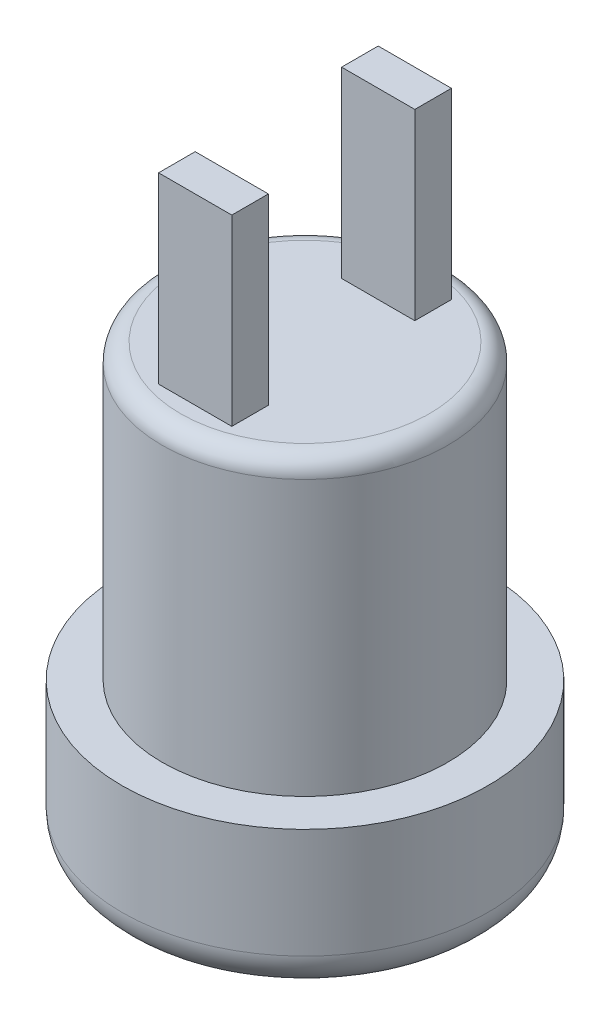
ISO-10303-21;
HEADER;
FILE_DESCRIPTION(('STEP AP214'),'2;1');
FILE_NAME('part.step','',(''),(''),'','','');
FILE_SCHEMA(('AUTOMOTIVE_DESIGN { 1 0 10303 214 1 1 1 1 }'));
ENDSEC;
DATA;
#1=APPLICATION_CONTEXT('core data for automotive mechanical design processes');
#2=APPLICATION_PROTOCOL_DEFINITION('international standard','automotive_design',2000,#1);
#3=PRODUCT_CONTEXT('',#1,'mechanical');
#4=PRODUCT('Part','Part','',(#3));
#5=PRODUCT_RELATED_PRODUCT_CATEGORY('part','',(#4));
#6=PRODUCT_DEFINITION_FORMATION('','',#4);
#7=PRODUCT_DEFINITION_CONTEXT('part definition',#1,'design');
#8=PRODUCT_DEFINITION('design','',#6,#7);
#9=PRODUCT_DEFINITION_SHAPE('','',#8);
#10=(LENGTH_UNIT() NAMED_UNIT(*) SI_UNIT(.MILLI.,.METRE.));
#11=(NAMED_UNIT(*) PLANE_ANGLE_UNIT() SI_UNIT($,.RADIAN.));
#12=(NAMED_UNIT(*) SI_UNIT($,.STERADIAN.) SOLID_ANGLE_UNIT());
#13=UNCERTAINTY_MEASURE_WITH_UNIT(LENGTH_MEASURE(1.E-05),#10,'distance_accuracy_value','');
#14=(GEOMETRIC_REPRESENTATION_CONTEXT(3) GLOBAL_UNCERTAINTY_ASSIGNED_CONTEXT((#13)) GLOBAL_UNIT_ASSIGNED_CONTEXT((#10,
#11,#12)) REPRESENTATION_CONTEXT('',''));
#15=CARTESIAN_POINT('',(0.,0.,0.));
#16=DIRECTION('',(0.,0.,1.));
#17=DIRECTION('',(1.,0.,0.));
#18=AXIS2_PLACEMENT_3D('',#15,#16,#17);
#19=CARTESIAN_POINT('',(0.,12.,0.));
#20=DIRECTION('',(0.,1.,0.));
#21=DIRECTION('',(0.,0.,1.));
#22=AXIS2_PLACEMENT_3D('',#19,#20,#21);
#23=PLANE('',#22);
#24=CARTESIAN_POINT('',(0.,12.,0.));
#25=DIRECTION('',(0.,1.,0.));
#26=DIRECTION('',(0.,0.,1.));
#27=AXIS2_PLACEMENT_3D('',#24,#25,#26);
#28=CIRCLE('',#27,3.4);
#29=CARTESIAN_POINT('',(0.,12.,3.4));
#30=VERTEX_POINT('',#29);
#31=EDGE_CURVE('E53',#30,#30,#28,.T.);
#32=ORIENTED_EDGE('',*,*,#31,.T.);
#33=EDGE_LOOP('',(#32));
#34=FACE_BOUND('',#33,.T.);
#35=DIRECTION('',(-1.,0.,0.));
#36=VECTOR('',#35,1.);
#37=CARTESIAN_POINT('',(1.,12.,2.));
#38=LINE('',#37,#36);
#39=CARTESIAN_POINT('',(1.,12.,2.));
#40=VERTEX_POINT('',#39);
#41=CARTESIAN_POINT('',(-1.,12.,2.));
#42=VERTEX_POINT('',#41);
#43=EDGE_CURVE('E139',#40,#42,#38,.T.);
#44=ORIENTED_EDGE('',*,*,#43,.F.);
#45=DIRECTION('',(0.,0.,-1.));
#46=VECTOR('',#45,1.);
#47=CARTESIAN_POINT('',(1.,12.,3.));
#48=LINE('',#47,#46);
#49=CARTESIAN_POINT('',(1.,12.,3.));
#50=VERTEX_POINT('',#49);
#51=EDGE_CURVE('E136',#50,#40,#48,.T.);
#52=ORIENTED_EDGE('',*,*,#51,.F.);
#53=DIRECTION('',(1.,0.,0.));
#54=VECTOR('',#53,1.);
#55=CARTESIAN_POINT('',(1.,12.,3.));
#56=LINE('',#55,#54);
#57=CARTESIAN_POINT('',(-1.,12.,3.));
#58=VERTEX_POINT('',#57);
#59=EDGE_CURVE('E148',#58,#50,#56,.T.);
#60=ORIENTED_EDGE('',*,*,#59,.F.);
#61=DIRECTION('',(0.,0.,1.));
#62=VECTOR('',#61,1.);
#63=CARTESIAN_POINT('',(-1.,12.,3.));
#64=LINE('',#63,#62);
#65=EDGE_CURVE('E156',#42,#58,#64,.T.);
#66=ORIENTED_EDGE('',*,*,#65,.F.);
#67=EDGE_LOOP('',(#44,#52,#60,#66));
#68=FACE_BOUND('',#67,.T.);
#69=DIRECTION('',(0.,0.,1.));
#70=VECTOR('',#69,1.);
#71=CARTESIAN_POINT('',(-1.,12.,-3.));
#72=LINE('',#71,#70);
#73=CARTESIAN_POINT('',(-1.,12.,-3.));
#74=VERTEX_POINT('',#73);
#75=CARTESIAN_POINT('',(-1.,12.,-2.));
#76=VERTEX_POINT('',#75);
#77=EDGE_CURVE('E284',#74,#76,#72,.T.);
#78=ORIENTED_EDGE('',*,*,#77,.F.);
#79=DIRECTION('',(-1.,0.,0.));
#80=VECTOR('',#79,1.);
#81=CARTESIAN_POINT('',(1.,12.,-3.));
#82=LINE('',#81,#80);
#83=CARTESIAN_POINT('',(1.,12.,-3.));
#84=VERTEX_POINT('',#83);
#85=EDGE_CURVE('E134',#84,#74,#82,.T.);
#86=ORIENTED_EDGE('',*,*,#85,.F.);
#87=DIRECTION('',(0.,0.,-1.));
#88=VECTOR('',#87,1.);
#89=CARTESIAN_POINT('',(1.,12.,-3.));
#90=LINE('',#89,#88);
#91=CARTESIAN_POINT('',(1.,12.,-2.));
#92=VERTEX_POINT('',#91);
#93=EDGE_CURVE('E130',#92,#84,#90,.T.);
#94=ORIENTED_EDGE('',*,*,#93,.F.);
#95=DIRECTION('',(1.,0.,0.));
#96=VECTOR('',#95,1.);
#97=CARTESIAN_POINT('',(1.,12.,-2.));
#98=LINE('',#97,#96);
#99=EDGE_CURVE('E281',#76,#92,#98,.T.);
#100=ORIENTED_EDGE('',*,*,#99,.F.);
#101=EDGE_LOOP('',(#78,#86,#94,#100));
#102=FACE_BOUND('',#101,.T.);
#103=ADVANCED_FACE('F45',(#34,#68,#102),#23,.T.);
#104=CARTESIAN_POINT('',(0.,4.,0.));
#105=DIRECTION('',(0.,-1.,0.));
#106=DIRECTION('',(0.,0.,-1.));
#107=AXIS2_PLACEMENT_3D('',#104,#105,#106);
#108=CYLINDRICAL_SURFACE('',#107,5.);
#109=CARTESIAN_POINT('',(0.,1.,0.));
#110=DIRECTION('',(0.,1.,0.));
#111=DIRECTION('',(0.,0.,1.));
#112=AXIS2_PLACEMENT_3D('',#109,#110,#111);
#113=CIRCLE('',#112,5.);
#114=CARTESIAN_POINT('',(0.,1.,5.));
#115=VERTEX_POINT('',#114);
#116=EDGE_CURVE('E177',#115,#115,#113,.T.);
#117=ORIENTED_EDGE('',*,*,#116,.T.);
#118=EDGE_LOOP('',(#117));
#119=FACE_BOUND('',#118,.T.);
#120=CARTESIAN_POINT('',(0.,4.,0.));
#121=DIRECTION('',(0.,1.,0.));
#122=DIRECTION('',(0.,0.,1.));
#123=AXIS2_PLACEMENT_3D('',#120,#121,#122);
#124=CIRCLE('',#123,5.);
#125=CARTESIAN_POINT('',(0.,4.,5.));
#126=VERTEX_POINT('',#125);
#127=EDGE_CURVE('E171',#126,#126,#124,.T.);
#128=ORIENTED_EDGE('',*,*,#127,.F.);
#129=EDGE_LOOP('',(#128));
#130=FACE_BOUND('',#129,.T.);
#131=ADVANCED_FACE('F198',(#119,#130),#108,.T.);
#132=CARTESIAN_POINT('',(0.,4.,0.));
#133=DIRECTION('',(0.,1.,0.));
#134=DIRECTION('',(0.,0.,1.));
#135=AXIS2_PLACEMENT_3D('',#132,#133,#134);
#136=PLANE('',#135);
#137=CARTESIAN_POINT('',(0.,4.,0.));
#138=DIRECTION('',(0.,1.,0.));
#139=DIRECTION('',(0.,0.,1.));
#140=AXIS2_PLACEMENT_3D('',#137,#138,#139);
#141=CIRCLE('',#140,3.9);
#142=CARTESIAN_POINT('',(0.,4.,3.9));
#143=VERTEX_POINT('',#142);
#144=EDGE_CURVE('E174',#143,#143,#141,.T.);
#145=ORIENTED_EDGE('',*,*,#144,.F.);
#146=EDGE_LOOP('',(#145));
#147=FACE_BOUND('',#146,.T.);
#148=ORIENTED_EDGE('',*,*,#127,.T.);
#149=EDGE_LOOP('',(#148));
#150=FACE_BOUND('',#149,.T.);
#151=ADVANCED_FACE('F205',(#147,#150),#136,.T.);
#152=CARTESIAN_POINT('',(0.,0.,0.));
#153=DIRECTION('',(0.,1.,0.));
#154=DIRECTION('',(0.,0.,1.));
#155=AXIS2_PLACEMENT_3D('',#152,#153,#154);
#156=PLANE('',#155);
#157=CARTESIAN_POINT('',(0.,0.,0.));
#158=DIRECTION('',(0.,-1.,0.));
#159=DIRECTION('',(0.,0.,-1.));
#160=AXIS2_PLACEMENT_3D('',#157,#158,#159);
#161=CIRCLE('',#160,3.);
#162=CARTESIAN_POINT('',(0.,0.,-3.));
#163=VERTEX_POINT('',#162);
#164=EDGE_CURVE('E167',#163,#163,#161,.T.);
#165=ORIENTED_EDGE('',*,*,#164,.F.);
#166=EDGE_LOOP('',(#165));
#167=FACE_BOUND('',#166,.T.);
#168=CARTESIAN_POINT('',(0.,0.,0.));
#169=DIRECTION('',(0.,1.,0.));
#170=DIRECTION('',(0.,0.,1.));
#171=AXIS2_PLACEMENT_3D('',#168,#169,#170);
#172=CIRCLE('',#171,4.);
#173=CARTESIAN_POINT('',(0.,0.,4.));
#174=VERTEX_POINT('',#173);
#175=EDGE_CURVE('E182',#174,#174,#172,.F.);
#176=ORIENTED_EDGE('',*,*,#175,.T.);
#177=EDGE_LOOP('',(#176));
#178=FACE_BOUND('',#177,.T.);
#179=ADVANCED_FACE('F215',(#167,#178),#156,.F.);
#180=CARTESIAN_POINT('',(0.,12.,0.));
#181=DIRECTION('',(0.,-1.,0.));
#182=DIRECTION('',(0.,0.,-1.));
#183=AXIS2_PLACEMENT_3D('',#180,#181,#182);
#184=CYLINDRICAL_SURFACE('',#183,3.9);
#185=CARTESIAN_POINT('',(0.,11.5,0.));
#186=DIRECTION('',(0.,1.,0.));
#187=DIRECTION('',(0.,0.,1.));
#188=AXIS2_PLACEMENT_3D('',#185,#186,#187);
#189=CIRCLE('',#188,3.9);
#190=CARTESIAN_POINT('',(0.,11.5,3.9));
#191=VERTEX_POINT('',#190);
#192=EDGE_CURVE('E11',#191,#191,#189,.F.);
#193=ORIENTED_EDGE('',*,*,#192,.T.);
#194=EDGE_LOOP('',(#193));
#195=FACE_BOUND('',#194,.T.);
#196=ORIENTED_EDGE('',*,*,#144,.T.);
#197=EDGE_LOOP('',(#196));
#198=FACE_BOUND('',#197,.T.);
#199=ADVANCED_FACE('F212',(#195,#198),#184,.T.);
#200=CARTESIAN_POINT('',(0.,1.,0.));
#201=DIRECTION('',(0.,1.,0.));
#202=DIRECTION('',(0.,0.,1.));
#203=AXIS2_PLACEMENT_3D('',#200,#201,#202);
#204=TOROIDAL_SURFACE('',#203,4.,1.);
#205=ORIENTED_EDGE('',*,*,#175,.F.);
#206=EDGE_LOOP('',(#205));
#207=FACE_BOUND('',#206,.T.);
#208=ORIENTED_EDGE('',*,*,#116,.F.);
#209=EDGE_LOOP('',(#208));
#210=FACE_BOUND('',#209,.T.);
#211=ADVANCED_FACE('F214',(#207,#210),#204,.T.);
#212=CARTESIAN_POINT('',(0.,6.,0.));
#213=DIRECTION('',(0.,-1.,0.));
#214=DIRECTION('',(0.,0.,-1.));
#215=AXIS2_PLACEMENT_3D('',#212,#213,#214);
#216=CYLINDRICAL_SURFACE('',#215,3.);
#217=CARTESIAN_POINT('',(0.,6.,0.));
#218=DIRECTION('',(0.,-1.,0.));
#219=DIRECTION('',(0.,0.,-1.));
#220=AXIS2_PLACEMENT_3D('',#217,#218,#219);
#221=CIRCLE('',#220,3.);
#222=CARTESIAN_POINT('',(0.,6.,-3.));
#223=VERTEX_POINT('',#222);
#224=EDGE_CURVE('E168',#223,#223,#221,.T.);
#225=ORIENTED_EDGE('',*,*,#224,.F.);
#226=EDGE_LOOP('',(#225));
#227=FACE_BOUND('',#226,.T.);
#228=ORIENTED_EDGE('',*,*,#164,.T.);
#229=EDGE_LOOP('',(#228));
#230=FACE_BOUND('',#229,.T.);
#231=ADVANCED_FACE('F210',(#227,#230),#216,.F.);
#232=CARTESIAN_POINT('',(0.,6.,0.));
#233=DIRECTION('',(0.,-1.,0.));
#234=DIRECTION('',(0.,0.,-1.));
#235=AXIS2_PLACEMENT_3D('',#232,#233,#234);
#236=PLANE('',#235);
#237=ORIENTED_EDGE('',*,*,#224,.T.);
#238=EDGE_LOOP('',(#237));
#239=FACE_BOUND('',#238,.T.);
#240=ADVANCED_FACE('F227',(#239),#236,.T.);
#241=CARTESIAN_POINT('',(1.,17.,3.));
#242=DIRECTION('',(-1.,0.,0.));
#243=DIRECTION('',(0.,0.,1.));
#244=AXIS2_PLACEMENT_3D('',#241,#242,#243);
#245=PLANE('',#244);
#246=ORIENTED_EDGE('',*,*,#51,.T.);
#247=DIRECTION('',(0.,-1.,0.));
#248=VECTOR('',#247,1.);
#249=CARTESIAN_POINT('',(1.,17.,2.));
#250=LINE('',#249,#248);
#251=CARTESIAN_POINT('',(1.,17.,2.));
#252=VERTEX_POINT('',#251);
#253=EDGE_CURVE('E165',#252,#40,#250,.T.);
#254=ORIENTED_EDGE('',*,*,#253,.F.);
#255=DIRECTION('',(0.,0.,-1.));
#256=VECTOR('',#255,1.);
#257=CARTESIAN_POINT('',(1.,17.,3.));
#258=LINE('',#257,#256);
#259=CARTESIAN_POINT('',(1.,17.,3.));
#260=VERTEX_POINT('',#259);
#261=EDGE_CURVE('E144',#260,#252,#258,.T.);
#262=ORIENTED_EDGE('',*,*,#261,.F.);
#263=DIRECTION('',(0.,-1.,0.));
#264=VECTOR('',#263,1.);
#265=CARTESIAN_POINT('',(1.,17.,3.));
#266=LINE('',#265,#264);
#267=EDGE_CURVE('E153',#260,#50,#266,.T.);
#268=ORIENTED_EDGE('',*,*,#267,.T.);
#269=EDGE_LOOP('',(#246,#254,#262,#268));
#270=FACE_BOUND('',#269,.T.);
#271=ADVANCED_FACE('F239',(#270),#245,.F.);
#272=CARTESIAN_POINT('',(1.,17.,2.));
#273=DIRECTION('',(0.,0.,1.));
#274=DIRECTION('',(1.,0.,0.));
#275=AXIS2_PLACEMENT_3D('',#272,#273,#274);
#276=PLANE('',#275);
#277=ORIENTED_EDGE('',*,*,#43,.T.);
#278=DIRECTION('',(0.,-1.,0.));
#279=VECTOR('',#278,1.);
#280=CARTESIAN_POINT('',(-1.,17.,2.));
#281=LINE('',#280,#279);
#282=CARTESIAN_POINT('',(-1.,17.,2.));
#283=VERTEX_POINT('',#282);
#284=EDGE_CURVE('E162',#283,#42,#281,.T.);
#285=ORIENTED_EDGE('',*,*,#284,.F.);
#286=DIRECTION('',(-1.,0.,0.));
#287=VECTOR('',#286,1.);
#288=CARTESIAN_POINT('',(1.,17.,2.));
#289=LINE('',#288,#287);
#290=EDGE_CURVE('E147',#252,#283,#289,.T.);
#291=ORIENTED_EDGE('',*,*,#290,.F.);
#292=ORIENTED_EDGE('',*,*,#253,.T.);
#293=EDGE_LOOP('',(#277,#285,#291,#292));
#294=FACE_BOUND('',#293,.T.);
#295=ADVANCED_FACE('F248',(#294),#276,.F.);
#296=CARTESIAN_POINT('',(-1.,17.,3.));
#297=DIRECTION('',(1.,0.,0.));
#298=DIRECTION('',(0.,0.,-1.));
#299=AXIS2_PLACEMENT_3D('',#296,#297,#298);
#300=PLANE('',#299);
#301=ORIENTED_EDGE('',*,*,#65,.T.);
#302=DIRECTION('',(0.,-1.,0.));
#303=VECTOR('',#302,1.);
#304=CARTESIAN_POINT('',(-1.,17.,3.));
#305=LINE('',#304,#303);
#306=CARTESIAN_POINT('',(-1.,17.,3.));
#307=VERTEX_POINT('',#306);
#308=EDGE_CURVE('E68',#307,#58,#305,.T.);
#309=ORIENTED_EDGE('',*,*,#308,.F.);
#310=DIRECTION('',(0.,0.,1.));
#311=VECTOR('',#310,1.);
#312=CARTESIAN_POINT('',(-1.,17.,3.));
#313=LINE('',#312,#311);
#314=EDGE_CURVE('E150',#283,#307,#313,.T.);
#315=ORIENTED_EDGE('',*,*,#314,.F.);
#316=ORIENTED_EDGE('',*,*,#284,.T.);
#317=EDGE_LOOP('',(#301,#309,#315,#316));
#318=FACE_BOUND('',#317,.T.);
#319=ADVANCED_FACE('F254',(#318),#300,.F.);
#320=CARTESIAN_POINT('',(1.,17.,3.));
#321=DIRECTION('',(0.,0.,-1.));
#322=DIRECTION('',(-1.,0.,0.));
#323=AXIS2_PLACEMENT_3D('',#320,#321,#322);
#324=PLANE('',#323);
#325=ORIENTED_EDGE('',*,*,#59,.T.);
#326=ORIENTED_EDGE('',*,*,#267,.F.);
#327=DIRECTION('',(1.,0.,0.));
#328=VECTOR('',#327,1.);
#329=CARTESIAN_POINT('',(1.,17.,3.));
#330=LINE('',#329,#328);
#331=EDGE_CURVE('E152',#307,#260,#330,.T.);
#332=ORIENTED_EDGE('',*,*,#331,.F.);
#333=ORIENTED_EDGE('',*,*,#308,.T.);
#334=EDGE_LOOP('',(#325,#326,#332,#333));
#335=FACE_BOUND('',#334,.T.);
#336=ADVANCED_FACE('F258',(#335),#324,.F.);
#337=CARTESIAN_POINT('',(0.,17.,0.));
#338=DIRECTION('',(0.,1.,0.));
#339=DIRECTION('',(0.,0.,1.));
#340=AXIS2_PLACEMENT_3D('',#337,#338,#339);
#341=PLANE('',#340);
#342=ORIENTED_EDGE('',*,*,#261,.T.);
#343=ORIENTED_EDGE('',*,*,#290,.T.);
#344=ORIENTED_EDGE('',*,*,#314,.T.);
#345=ORIENTED_EDGE('',*,*,#331,.T.);
#346=EDGE_LOOP('',(#342,#343,#344,#345));
#347=FACE_BOUND('',#346,.T.);
#348=ADVANCED_FACE('F262',(#347),#341,.T.);
#349=CARTESIAN_POINT('',(1.,17.,-3.));
#350=DIRECTION('',(0.,0.,1.));
#351=DIRECTION('',(1.,0.,0.));
#352=AXIS2_PLACEMENT_3D('',#349,#350,#351);
#353=PLANE('',#352);
#354=ORIENTED_EDGE('',*,*,#85,.T.);
#355=DIRECTION('',(0.,-1.,0.));
#356=VECTOR('',#355,1.);
#357=CARTESIAN_POINT('',(-1.,17.,-3.));
#358=LINE('',#357,#356);
#359=CARTESIAN_POINT('',(-1.,17.,-3.));
#360=VERTEX_POINT('',#359);
#361=EDGE_CURVE('E115',#360,#74,#358,.T.);
#362=ORIENTED_EDGE('',*,*,#361,.F.);
#363=DIRECTION('',(-1.,0.,0.));
#364=VECTOR('',#363,1.);
#365=CARTESIAN_POINT('',(1.,17.,-3.));
#366=LINE('',#365,#364);
#367=CARTESIAN_POINT('',(1.,17.,-3.));
#368=VERTEX_POINT('',#367);
#369=EDGE_CURVE('E122',#368,#360,#366,.T.);
#370=ORIENTED_EDGE('',*,*,#369,.F.);
#371=DIRECTION('',(0.,-1.,0.));
#372=VECTOR('',#371,1.);
#373=CARTESIAN_POINT('',(1.,17.,-3.));
#374=LINE('',#373,#372);
#375=EDGE_CURVE('E278',#368,#84,#374,.T.);
#376=ORIENTED_EDGE('',*,*,#375,.T.);
#377=EDGE_LOOP('',(#354,#362,#370,#376));
#378=FACE_BOUND('',#377,.T.);
#379=ADVANCED_FACE('F132',(#378),#353,.F.);
#380=CARTESIAN_POINT('',(-1.,17.,-3.));
#381=DIRECTION('',(1.,0.,0.));
#382=DIRECTION('',(0.,0.,-1.));
#383=AXIS2_PLACEMENT_3D('',#380,#381,#382);
#384=PLANE('',#383);
#385=ORIENTED_EDGE('',*,*,#77,.T.);
#386=DIRECTION('',(0.,-1.,0.));
#387=VECTOR('',#386,1.);
#388=CARTESIAN_POINT('',(-1.,17.,-2.));
#389=LINE('',#388,#387);
#390=CARTESIAN_POINT('',(-1.,17.,-2.));
#391=VERTEX_POINT('',#390);
#392=EDGE_CURVE('E118',#391,#76,#389,.T.);
#393=ORIENTED_EDGE('',*,*,#392,.F.);
#394=DIRECTION('',(0.,0.,1.));
#395=VECTOR('',#394,1.);
#396=CARTESIAN_POINT('',(-1.,17.,-3.));
#397=LINE('',#396,#395);
#398=EDGE_CURVE('E111',#360,#391,#397,.T.);
#399=ORIENTED_EDGE('',*,*,#398,.F.);
#400=ORIENTED_EDGE('',*,*,#361,.T.);
#401=EDGE_LOOP('',(#385,#393,#399,#400));
#402=FACE_BOUND('',#401,.T.);
#403=ADVANCED_FACE('F113',(#402),#384,.F.);
#404=CARTESIAN_POINT('',(1.,17.,-2.));
#405=DIRECTION('',(0.,0.,-1.));
#406=DIRECTION('',(-1.,0.,0.));
#407=AXIS2_PLACEMENT_3D('',#404,#405,#406);
#408=PLANE('',#407);
#409=ORIENTED_EDGE('',*,*,#99,.T.);
#410=DIRECTION('',(0.,-1.,0.));
#411=VECTOR('',#410,1.);
#412=CARTESIAN_POINT('',(1.,17.,-2.));
#413=LINE('',#412,#411);
#414=CARTESIAN_POINT('',(1.,17.,-2.));
#415=VERTEX_POINT('',#414);
#416=EDGE_CURVE('E60',#415,#92,#413,.T.);
#417=ORIENTED_EDGE('',*,*,#416,.F.);
#418=DIRECTION('',(1.,0.,0.));
#419=VECTOR('',#418,1.);
#420=CARTESIAN_POINT('',(1.,17.,-2.));
#421=LINE('',#420,#419);
#422=EDGE_CURVE('E121',#391,#415,#421,.T.);
#423=ORIENTED_EDGE('',*,*,#422,.F.);
#424=ORIENTED_EDGE('',*,*,#392,.T.);
#425=EDGE_LOOP('',(#409,#417,#423,#424));
#426=FACE_BOUND('',#425,.T.);
#427=ADVANCED_FACE('F270',(#426),#408,.F.);
#428=CARTESIAN_POINT('',(1.,17.,-3.));
#429=DIRECTION('',(-1.,0.,0.));
#430=DIRECTION('',(0.,0.,1.));
#431=AXIS2_PLACEMENT_3D('',#428,#429,#430);
#432=PLANE('',#431);
#433=ORIENTED_EDGE('',*,*,#93,.T.);
#434=ORIENTED_EDGE('',*,*,#375,.F.);
#435=DIRECTION('',(0.,0.,-1.));
#436=VECTOR('',#435,1.);
#437=CARTESIAN_POINT('',(1.,17.,-3.));
#438=LINE('',#437,#436);
#439=EDGE_CURVE('E126',#415,#368,#438,.T.);
#440=ORIENTED_EDGE('',*,*,#439,.F.);
#441=ORIENTED_EDGE('',*,*,#416,.T.);
#442=EDGE_LOOP('',(#433,#434,#440,#441));
#443=FACE_BOUND('',#442,.T.);
#444=ADVANCED_FACE('F194',(#443),#432,.F.);
#445=CARTESIAN_POINT('',(0.,17.,0.));
#446=DIRECTION('',(0.,1.,0.));
#447=DIRECTION('',(0.,0.,1.));
#448=AXIS2_PLACEMENT_3D('',#445,#446,#447);
#449=PLANE('',#448);
#450=ORIENTED_EDGE('',*,*,#369,.T.);
#451=ORIENTED_EDGE('',*,*,#398,.T.);
#452=ORIENTED_EDGE('',*,*,#422,.T.);
#453=ORIENTED_EDGE('',*,*,#439,.T.);
#454=EDGE_LOOP('',(#450,#451,#452,#453));
#455=FACE_BOUND('',#454,.T.);
#456=ADVANCED_FACE('F125',(#455),#449,.T.);
#457=CARTESIAN_POINT('',(0.,11.5,0.));
#458=DIRECTION('',(0.,1.,0.));
#459=DIRECTION('',(0.,0.,1.));
#460=AXIS2_PLACEMENT_3D('',#457,#458,#459);
#461=TOROIDAL_SURFACE('',#460,3.4,0.5);
#462=ORIENTED_EDGE('',*,*,#192,.F.);
#463=EDGE_LOOP('',(#462));
#464=FACE_BOUND('',#463,.T.);
#465=ORIENTED_EDGE('',*,*,#31,.F.);
#466=EDGE_LOOP('',(#465));
#467=FACE_BOUND('',#466,.T.);
#468=ADVANCED_FACE('F47',(#464,#467),#461,.T.);
#469=CLOSED_SHELL('',(#103,#131,#151,#179,#199,#211,#231,#240,#271,#295,#319,#336,#348,#379,
#403,#427,#444,#456,#468));
#470=MANIFOLD_SOLID_BREP('B2',#469);
#471=ADVANCED_BREP_SHAPE_REPRESENTATION('',(#18,#470),#14);
#472=SHAPE_DEFINITION_REPRESENTATION(#9,#471);
ENDSEC;
END-ISO-10303-21;
